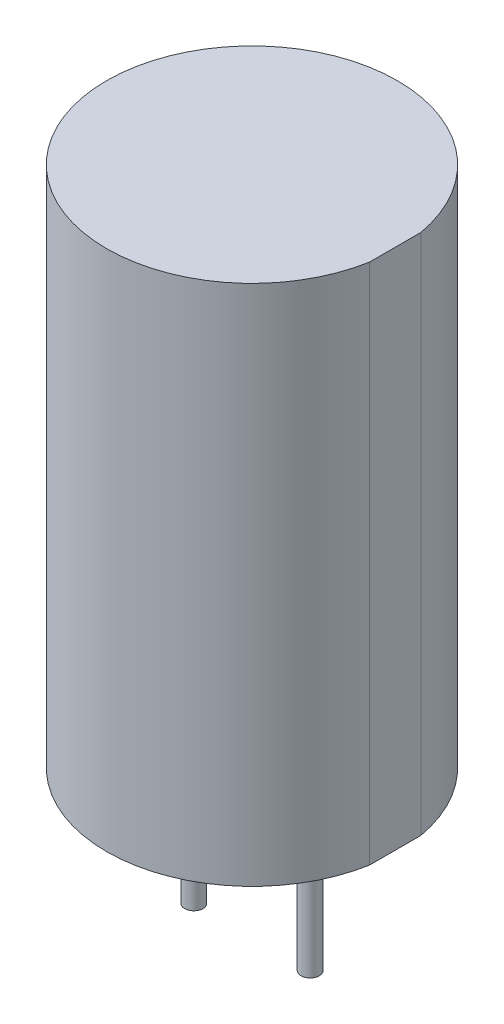
ISO-10303-21;
HEADER;
FILE_DESCRIPTION(('STEP AP214'),'2;1');
FILE_NAME('part.step','',(''),(''),'','','');
FILE_SCHEMA(('AUTOMOTIVE_DESIGN { 1 0 10303 214 1 1 1 1 }'));
ENDSEC;
DATA;
#1=APPLICATION_CONTEXT('core data for automotive mechanical design processes');
#2=APPLICATION_PROTOCOL_DEFINITION('international standard','automotive_design',2000,#1);
#3=PRODUCT_CONTEXT('',#1,'mechanical');
#4=PRODUCT('Part','Part','',(#3));
#5=PRODUCT_RELATED_PRODUCT_CATEGORY('part','',(#4));
#6=PRODUCT_DEFINITION_FORMATION('','',#4);
#7=PRODUCT_DEFINITION_CONTEXT('part definition',#1,'design');
#8=PRODUCT_DEFINITION('design','',#6,#7);
#9=PRODUCT_DEFINITION_SHAPE('','',#8);
#10=(LENGTH_UNIT() NAMED_UNIT(*) SI_UNIT(.MILLI.,.METRE.));
#11=(NAMED_UNIT(*) PLANE_ANGLE_UNIT() SI_UNIT($,.RADIAN.));
#12=(NAMED_UNIT(*) SI_UNIT($,.STERADIAN.) SOLID_ANGLE_UNIT());
#13=UNCERTAINTY_MEASURE_WITH_UNIT(LENGTH_MEASURE(1.E-05),#10,'distance_accuracy_value','');
#14=(GEOMETRIC_REPRESENTATION_CONTEXT(3) GLOBAL_UNCERTAINTY_ASSIGNED_CONTEXT((#13)) GLOBAL_UNIT_ASSIGNED_CONTEXT((#10,
#11,#12)) REPRESENTATION_CONTEXT('',''));
#15=CARTESIAN_POINT('',(0.,0.,0.));
#16=DIRECTION('',(0.,0.,1.));
#17=DIRECTION('',(1.,0.,0.));
#18=AXIS2_PLACEMENT_3D('',#15,#16,#17);
#19=CARTESIAN_POINT('',(0.,11.4,0.));
#20=DIRECTION('',(0.,-1.,0.));
#21=DIRECTION('',(0.,0.,-1.));
#22=AXIS2_PLACEMENT_3D('',#19,#20,#21);
#23=CYLINDRICAL_SURFACE('',#22,3.175);
#24=CARTESIAN_POINT('',(0.,0.,0.));
#25=DIRECTION('',(0.,1.,0.));
#26=DIRECTION('',(0.,0.,1.));
#27=AXIS2_PLACEMENT_3D('',#24,#25,#26);
#28=CIRCLE('',#27,3.175);
#29=CARTESIAN_POINT('',(3.125,0.,-0.561248608016089));
#30=VERTEX_POINT('',#29);
#31=CARTESIAN_POINT('',(3.125,0.,0.561248608016089));
#32=VERTEX_POINT('',#31);
#33=EDGE_CURVE('E87',#30,#32,#28,.T.);
#34=ORIENTED_EDGE('',*,*,#33,.T.);
#35=DIRECTION('',(0.,-1.,0.));
#36=VECTOR('',#35,1.);
#37=CARTESIAN_POINT('',(3.125,11.4,0.561248608016089));
#38=LINE('',#37,#36);
#39=CARTESIAN_POINT('',(3.125,11.4,0.561248608016089));
#40=VERTEX_POINT('',#39);
#41=EDGE_CURVE('E83',#40,#32,#38,.T.);
#42=ORIENTED_EDGE('',*,*,#41,.F.);
#43=CARTESIAN_POINT('',(0.,11.4,0.));
#44=DIRECTION('',(0.,1.,0.));
#45=DIRECTION('',(0.,0.,1.));
#46=AXIS2_PLACEMENT_3D('',#43,#44,#45);
#47=CIRCLE('',#46,3.175);
#48=CARTESIAN_POINT('',(3.125,11.4,-0.561248608016089));
#49=VERTEX_POINT('',#48);
#50=EDGE_CURVE('E86',#49,#40,#47,.T.);
#51=ORIENTED_EDGE('',*,*,#50,.F.);
#52=DIRECTION('',(0.,-1.,0.));
#53=VECTOR('',#52,1.);
#54=CARTESIAN_POINT('',(3.125,11.4,-0.561248608016089));
#55=LINE('',#54,#53);
#56=EDGE_CURVE('E80',#49,#30,#55,.T.);
#57=ORIENTED_EDGE('',*,*,#56,.T.);
#58=EDGE_LOOP('',(#34,#42,#51,#57));
#59=FACE_BOUND('',#58,.T.);
#60=ADVANCED_FACE('F51',(#59),#23,.T.);
#61=CARTESIAN_POINT('',(3.125,11.4,-0.561248608016089));
#62=DIRECTION('',(-1.,0.,0.));
#63=DIRECTION('',(0.,0.,1.));
#64=AXIS2_PLACEMENT_3D('',#61,#62,#63);
#65=PLANE('',#64);
#66=DIRECTION('',(0.,0.,-1.));
#67=VECTOR('',#66,1.);
#68=CARTESIAN_POINT('',(3.125,0.,-0.561248608016089));
#69=LINE('',#68,#67);
#70=EDGE_CURVE('E75',#32,#30,#69,.T.);
#71=ORIENTED_EDGE('',*,*,#70,.T.);
#72=ORIENTED_EDGE('',*,*,#56,.F.);
#73=DIRECTION('',(0.,0.,-1.));
#74=VECTOR('',#73,1.);
#75=CARTESIAN_POINT('',(3.125,11.4,-0.561248608016089));
#76=LINE('',#75,#74);
#77=EDGE_CURVE('E67',#40,#49,#76,.T.);
#78=ORIENTED_EDGE('',*,*,#77,.F.);
#79=ORIENTED_EDGE('',*,*,#41,.T.);
#80=EDGE_LOOP('',(#71,#72,#78,#79));
#81=FACE_BOUND('',#80,.T.);
#82=ADVANCED_FACE('F79',(#81),#65,.F.);
#83=CARTESIAN_POINT('',(0.,11.4,0.));
#84=DIRECTION('',(0.,1.,0.));
#85=DIRECTION('',(0.,0.,1.));
#86=AXIS2_PLACEMENT_3D('',#83,#84,#85);
#87=PLANE('',#86);
#88=ORIENTED_EDGE('',*,*,#50,.T.);
#89=ORIENTED_EDGE('',*,*,#77,.T.);
#90=EDGE_LOOP('',(#88,#89));
#91=FACE_BOUND('',#90,.T.);
#92=ADVANCED_FACE('F111',(#91),#87,.T.);
#93=CARTESIAN_POINT('',(0.,0.,0.));
#94=DIRECTION('',(0.,1.,0.));
#95=DIRECTION('',(0.,0.,1.));
#96=AXIS2_PLACEMENT_3D('',#93,#94,#95);
#97=PLANE('',#96);
#98=CARTESIAN_POINT('',(1.27,0.,0.));
#99=DIRECTION('',(0.,1.,0.));
#100=DIRECTION('',(0.,0.,1.));
#101=AXIS2_PLACEMENT_3D('',#98,#99,#100);
#102=CIRCLE('',#101,0.2);
#103=CARTESIAN_POINT('',(1.27,0.,0.2));
#104=VERTEX_POINT('',#103);
#105=EDGE_CURVE('E11',#104,#104,#102,.F.);
#106=ORIENTED_EDGE('',*,*,#105,.F.);
#107=EDGE_LOOP('',(#106));
#108=FACE_BOUND('',#107,.T.);
#109=CARTESIAN_POINT('',(-1.27,0.,0.));
#110=DIRECTION('',(0.,1.,0.));
#111=DIRECTION('',(0.,0.,1.));
#112=AXIS2_PLACEMENT_3D('',#109,#110,#111);
#113=CIRCLE('',#112,0.2);
#114=CARTESIAN_POINT('',(-1.27,0.,0.2));
#115=VERTEX_POINT('',#114);
#116=EDGE_CURVE('E60',#115,#115,#113,.F.);
#117=ORIENTED_EDGE('',*,*,#116,.F.);
#118=EDGE_LOOP('',(#117));
#119=FACE_BOUND('',#118,.T.);
#120=ORIENTED_EDGE('',*,*,#33,.F.);
#121=ORIENTED_EDGE('',*,*,#70,.F.);
#122=EDGE_LOOP('',(#120,#121));
#123=FACE_BOUND('',#122,.T.);
#124=ADVANCED_FACE('F92',(#108,#119,#123),#97,.F.);
#125=CARTESIAN_POINT('',(-1.27,-3.2,0.));
#126=DIRECTION('',(0.,1.,0.));
#127=DIRECTION('',(0.,0.,1.));
#128=AXIS2_PLACEMENT_3D('',#125,#126,#127);
#129=CYLINDRICAL_SURFACE('',#128,0.2);
#130=CARTESIAN_POINT('',(-1.27,-3.2,0.));
#131=DIRECTION('',(0.,-1.,0.));
#132=DIRECTION('',(0.,0.,-1.));
#133=AXIS2_PLACEMENT_3D('',#130,#131,#132);
#134=CIRCLE('',#133,0.2);
#135=CARTESIAN_POINT('',(-1.27,-3.2,-0.2));
#136=VERTEX_POINT('',#135);
#137=EDGE_CURVE('E94',#136,#136,#134,.T.);
#138=ORIENTED_EDGE('',*,*,#137,.F.);
#139=EDGE_LOOP('',(#138));
#140=FACE_BOUND('',#139,.T.);
#141=ORIENTED_EDGE('',*,*,#116,.T.);
#142=EDGE_LOOP('',(#141));
#143=FACE_BOUND('',#142,.T.);
#144=ADVANCED_FACE('F108',(#140,#143),#129,.T.);
#145=CARTESIAN_POINT('',(-1.27,-3.2,0.));
#146=DIRECTION('',(0.,-1.,0.));
#147=DIRECTION('',(0.,0.,-1.));
#148=AXIS2_PLACEMENT_3D('',#145,#146,#147);
#149=PLANE('',#148);
#150=ORIENTED_EDGE('',*,*,#137,.T.);
#151=EDGE_LOOP('',(#150));
#152=FACE_BOUND('',#151,.T.);
#153=ADVANCED_FACE('F118',(#152),#149,.T.);
#154=CARTESIAN_POINT('',(1.27,-3.2,0.));
#155=DIRECTION('',(0.,1.,0.));
#156=DIRECTION('',(0.,0.,1.));
#157=AXIS2_PLACEMENT_3D('',#154,#155,#156);
#158=CYLINDRICAL_SURFACE('',#157,0.2);
#159=CARTESIAN_POINT('',(1.27,-3.2,0.));
#160=DIRECTION('',(0.,-1.,0.));
#161=DIRECTION('',(0.,0.,-1.));
#162=AXIS2_PLACEMENT_3D('',#159,#160,#161);
#163=CIRCLE('',#162,0.2);
#164=CARTESIAN_POINT('',(1.27,-3.2,-0.2));
#165=VERTEX_POINT('',#164);
#166=EDGE_CURVE('E98',#165,#165,#163,.T.);
#167=ORIENTED_EDGE('',*,*,#166,.F.);
#168=EDGE_LOOP('',(#167));
#169=FACE_BOUND('',#168,.T.);
#170=ORIENTED_EDGE('',*,*,#105,.T.);
#171=EDGE_LOOP('',(#170));
#172=FACE_BOUND('',#171,.T.);
#173=ADVANCED_FACE('F160',(#169,#172),#158,.T.);
#174=CARTESIAN_POINT('',(1.27,-3.2,0.));
#175=DIRECTION('',(0.,-1.,0.));
#176=DIRECTION('',(0.,0.,-1.));
#177=AXIS2_PLACEMENT_3D('',#174,#175,#176);
#178=PLANE('',#177);
#179=ORIENTED_EDGE('',*,*,#166,.T.);
#180=EDGE_LOOP('',(#179));
#181=FACE_BOUND('',#180,.T.);
#182=ADVANCED_FACE('F170',(#181),#178,.T.);
#183=CLOSED_SHELL('',(#60,#82,#92,#124,#144,#153,#173,#182));
#184=MANIFOLD_SOLID_BREP('B2',#183);
#185=ADVANCED_BREP_SHAPE_REPRESENTATION('',(#18,#184),#14);
#186=SHAPE_DEFINITION_REPRESENTATION(#9,#185);
ENDSEC;
END-ISO-10303-21;
